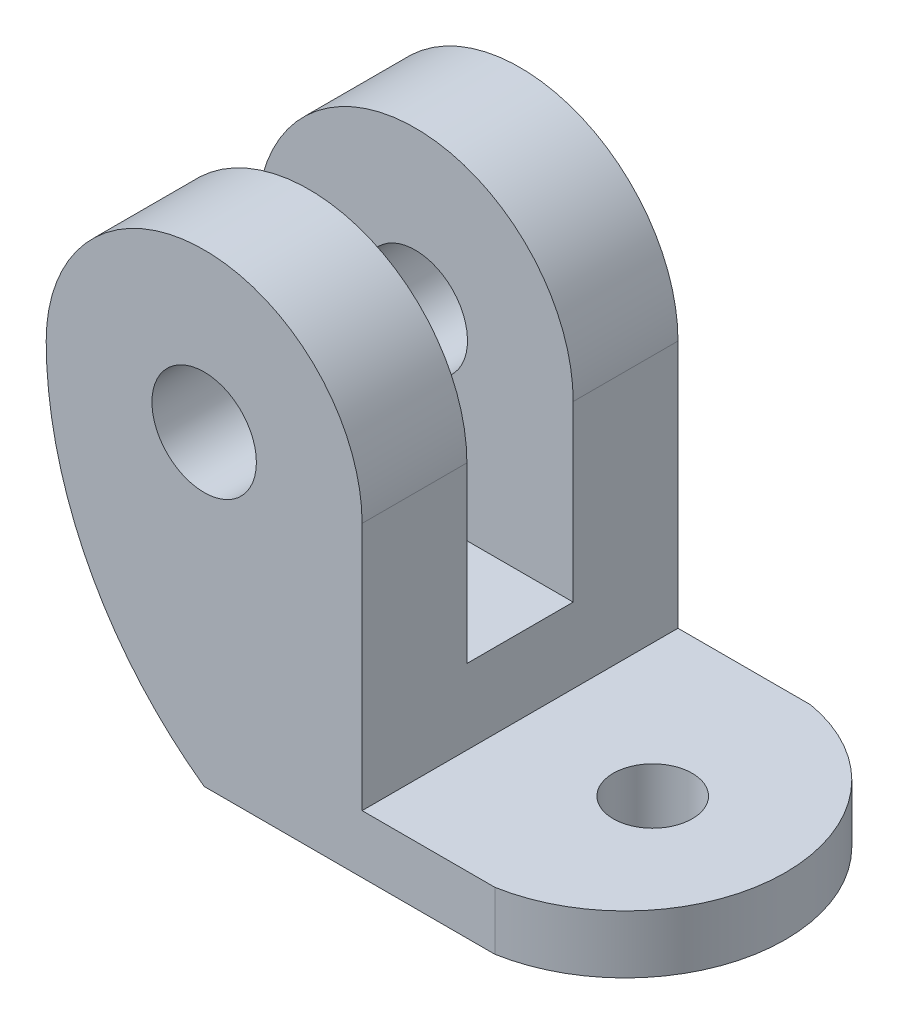
ISO-10303-21;
HEADER;
FILE_DESCRIPTION(('STEP AP214'),'2;1');
FILE_NAME('part.step','',(''),(''),'','','');
FILE_SCHEMA(('AUTOMOTIVE_DESIGN { 1 0 10303 214 1 1 1 1 }'));
ENDSEC;
DATA;
#1=APPLICATION_CONTEXT('core data for automotive mechanical design processes');
#2=APPLICATION_PROTOCOL_DEFINITION('international standard','automotive_design',2000,#1);
#3=PRODUCT_CONTEXT('',#1,'mechanical');
#4=PRODUCT('Part','Part','',(#3));
#5=PRODUCT_RELATED_PRODUCT_CATEGORY('part','',(#4));
#6=PRODUCT_DEFINITION_FORMATION('','',#4);
#7=PRODUCT_DEFINITION_CONTEXT('part definition',#1,'design');
#8=PRODUCT_DEFINITION('design','',#6,#7);
#9=PRODUCT_DEFINITION_SHAPE('','',#8);
#10=(LENGTH_UNIT() NAMED_UNIT(*) SI_UNIT(.MILLI.,.METRE.));
#11=(NAMED_UNIT(*) PLANE_ANGLE_UNIT() SI_UNIT($,.RADIAN.));
#12=(NAMED_UNIT(*) SI_UNIT($,.STERADIAN.) SOLID_ANGLE_UNIT());
#13=UNCERTAINTY_MEASURE_WITH_UNIT(LENGTH_MEASURE(1.E-05),#10,'distance_accuracy_value','');
#14=(GEOMETRIC_REPRESENTATION_CONTEXT(3) GLOBAL_UNCERTAINTY_ASSIGNED_CONTEXT((#13)) GLOBAL_UNIT_ASSIGNED_CONTEXT((#10,
#11,#12)) REPRESENTATION_CONTEXT('',''));
#15=CARTESIAN_POINT('',(0.,0.,0.));
#16=DIRECTION('',(0.,0.,1.));
#17=DIRECTION('',(1.,0.,0.));
#18=AXIS2_PLACEMENT_3D('',#15,#16,#17);
#19=CARTESIAN_POINT('',(4.7625,1.75,9.525));
#20=DIRECTION('',(0.,-1.,0.));
#21=DIRECTION('',(1.,0.,0.));
#22=AXIS2_PLACEMENT_3D('',#19,#20,#21);
#23=PLANE('',#22);
#24=CARTESIAN_POINT('',(8.7625,1.75,4.7625));
#25=DIRECTION('',(0.,1.,0.));
#26=DIRECTION('',(-1.,0.,0.));
#27=AXIS2_PLACEMENT_3D('',#24,#25,#26);
#28=CIRCLE('',#27,1.190625);
#29=CARTESIAN_POINT('',(7.571875,1.75,4.7625));
#30=VERTEX_POINT('',#29);
#31=EDGE_CURVE('E170',#30,#30,#28,.T.);
#32=ORIENTED_EDGE('',*,*,#31,.F.);
#33=EDGE_LOOP('',(#32));
#34=FACE_BOUND('',#33,.T.);
#35=DIRECTION('',(-1.,0.,0.));
#36=VECTOR('',#35,1.);
#37=CARTESIAN_POINT('',(4.7625,1.75,9.525));
#38=LINE('',#37,#36);
#39=CARTESIAN_POINT('',(8.7625,1.75,9.525));
#40=VERTEX_POINT('',#39);
#41=CARTESIAN_POINT('',(4.7625,1.75,9.525));
#42=VERTEX_POINT('',#41);
#43=EDGE_CURVE('E127',#40,#42,#38,.T.);
#44=ORIENTED_EDGE('',*,*,#43,.F.);
#45=CARTESIAN_POINT('',(7.92732421875,1.75,4.7625));
#46=DIRECTION('',(0.,1.,0.));
#47=DIRECTION('',(-1.,0.,0.));
#48=AXIS2_PLACEMENT_3D('',#45,#46,#47);
#49=CIRCLE('',#48,4.83517578125);
#50=CARTESIAN_POINT('',(8.7625,1.75,0.));
#51=VERTEX_POINT('',#50);
#52=EDGE_CURVE('E176',#51,#40,#49,.F.);
#53=ORIENTED_EDGE('',*,*,#52,.F.);
#54=DIRECTION('',(-1.,0.,0.));
#55=VECTOR('',#54,1.);
#56=CARTESIAN_POINT('',(4.7625,1.75,0.));
#57=LINE('',#56,#55);
#58=CARTESIAN_POINT('',(4.7625,1.75,0.));
#59=VERTEX_POINT('',#58);
#60=EDGE_CURVE('E188',#51,#59,#57,.T.);
#61=ORIENTED_EDGE('',*,*,#60,.T.);
#62=DIRECTION('',(0.,0.,-1.));
#63=VECTOR('',#62,1.);
#64=CARTESIAN_POINT('',(4.7625,1.75,9.525));
#65=LINE('',#64,#63);
#66=EDGE_CURVE('E12',#42,#59,#65,.T.);
#67=ORIENTED_EDGE('',*,*,#66,.F.);
#68=EDGE_LOOP('',(#44,#53,#61,#67));
#69=FACE_BOUND('',#68,.T.);
#70=ADVANCED_FACE('F75',(#34,#69),#23,.F.);
#71=CARTESIAN_POINT('',(12.7625,0.,9.525));
#72=DIRECTION('',(0.,1.,0.));
#73=DIRECTION('',(-1.,0.,0.));
#74=AXIS2_PLACEMENT_3D('',#71,#72,#73);
#75=PLANE('',#74);
#76=CARTESIAN_POINT('',(8.7625,0.,4.7625));
#77=DIRECTION('',(0.,1.,0.));
#78=DIRECTION('',(-1.,0.,0.));
#79=AXIS2_PLACEMENT_3D('',#76,#77,#78);
#80=CIRCLE('',#79,1.190625);
#81=CARTESIAN_POINT('',(7.571875,0.,4.7625));
#82=VERTEX_POINT('',#81);
#83=EDGE_CURVE('E222',#82,#82,#80,.F.);
#84=ORIENTED_EDGE('',*,*,#83,.F.);
#85=EDGE_LOOP('',(#84));
#86=FACE_BOUND('',#85,.T.);
#87=CARTESIAN_POINT('',(7.92732421875,0.,4.7625));
#88=DIRECTION('',(0.,1.,0.));
#89=DIRECTION('',(-1.,0.,0.));
#90=AXIS2_PLACEMENT_3D('',#87,#88,#89);
#91=CIRCLE('',#90,4.83517578125);
#92=CARTESIAN_POINT('',(8.7625,0.,9.525));
#93=VERTEX_POINT('',#92);
#94=CARTESIAN_POINT('',(8.7625,0.,0.));
#95=VERTEX_POINT('',#94);
#96=EDGE_CURVE('E162',#93,#95,#91,.T.);
#97=ORIENTED_EDGE('',*,*,#96,.F.);
#98=DIRECTION('',(1.,0.,0.));
#99=VECTOR('',#98,1.);
#100=CARTESIAN_POINT('',(12.7625,0.,9.525));
#101=LINE('',#100,#99);
#102=CARTESIAN_POINT('',(0.,0.,9.525));
#103=VERTEX_POINT('',#102);
#104=EDGE_CURVE('E165',#103,#93,#101,.T.);
#105=ORIENTED_EDGE('',*,*,#104,.F.);
#106=DIRECTION('',(0.,0.,-1.));
#107=VECTOR('',#106,1.);
#108=CARTESIAN_POINT('',(0.,0.,9.525));
#109=LINE('',#108,#107);
#110=CARTESIAN_POINT('',(0.,0.,0.));
#111=VERTEX_POINT('',#110);
#112=EDGE_CURVE('E180',#103,#111,#109,.T.);
#113=ORIENTED_EDGE('',*,*,#112,.T.);
#114=DIRECTION('',(1.,0.,0.));
#115=VECTOR('',#114,1.);
#116=CARTESIAN_POINT('',(12.7625,0.,0.));
#117=LINE('',#116,#115);
#118=EDGE_CURVE('E167',#111,#95,#117,.T.);
#119=ORIENTED_EDGE('',*,*,#118,.T.);
#120=EDGE_LOOP('',(#97,#105,#113,#119));
#121=FACE_BOUND('',#120,.T.);
#122=ADVANCED_FACE('F164',(#86,#121),#75,.F.);
#123=CARTESIAN_POINT('',(4.76249999999999,9.25,9.525));
#124=DIRECTION('',(-1.,0.,0.));
#125=DIRECTION('',(0.,-1.,0.));
#126=AXIS2_PLACEMENT_3D('',#123,#124,#125);
#127=PLANE('',#126);
#128=DIRECTION('',(0.,1.,0.));
#129=VECTOR('',#128,1.);
#130=CARTESIAN_POINT('',(4.7625,14.0125,6.365));
#131=LINE('',#130,#129);
#132=CARTESIAN_POINT('',(4.7625,4.01249999999999,6.365));
#133=VERTEX_POINT('',#132);
#134=CARTESIAN_POINT('',(4.7625,9.25,6.365));
#135=VERTEX_POINT('',#134);
#136=EDGE_CURVE('E225',#133,#135,#131,.T.);
#137=ORIENTED_EDGE('',*,*,#136,.T.);
#138=DIRECTION('',(0.,0.,-1.));
#139=VECTOR('',#138,1.);
#140=CARTESIAN_POINT('',(4.76249999999999,9.25,9.525));
#141=LINE('',#140,#139);
#142=CARTESIAN_POINT('',(4.76249999999999,9.25,9.525));
#143=VERTEX_POINT('',#142);
#144=EDGE_CURVE('E83',#143,#135,#141,.T.);
#145=ORIENTED_EDGE('',*,*,#144,.F.);
#146=DIRECTION('',(0.,1.,0.));
#147=VECTOR('',#146,1.);
#148=CARTESIAN_POINT('',(4.76249999999999,9.25,9.525));
#149=LINE('',#148,#147);
#150=EDGE_CURVE('E242',#42,#143,#149,.T.);
#151=ORIENTED_EDGE('',*,*,#150,.F.);
#152=ORIENTED_EDGE('',*,*,#66,.T.);
#153=DIRECTION('',(0.,1.,0.));
#154=VECTOR('',#153,1.);
#155=CARTESIAN_POINT('',(4.76249999999999,9.25,0.));
#156=LINE('',#155,#154);
#157=CARTESIAN_POINT('',(4.76249999999999,9.25,0.));
#158=VERTEX_POINT('',#157);
#159=EDGE_CURVE('E190',#59,#158,#156,.T.);
#160=ORIENTED_EDGE('',*,*,#159,.T.);
#161=CARTESIAN_POINT('',(4.7625,9.25,3.16));
#162=VERTEX_POINT('',#161);
#163=EDGE_CURVE('E202',#162,#158,#141,.T.);
#164=ORIENTED_EDGE('',*,*,#163,.F.);
#165=DIRECTION('',(0.,-1.,0.));
#166=VECTOR('',#165,1.);
#167=CARTESIAN_POINT('',(4.7625,4.01249999999999,3.16));
#168=LINE('',#167,#166);
#169=CARTESIAN_POINT('',(4.7625,4.01249999999999,3.16));
#170=VERTEX_POINT('',#169);
#171=EDGE_CURVE('E218',#162,#170,#168,.T.);
#172=ORIENTED_EDGE('',*,*,#171,.T.);
#173=DIRECTION('',(0.,0.,1.));
#174=VECTOR('',#173,1.);
#175=CARTESIAN_POINT('',(4.7625,4.01249999999999,6.365));
#176=LINE('',#175,#174);
#177=EDGE_CURVE('E221',#170,#133,#176,.T.);
#178=ORIENTED_EDGE('',*,*,#177,.T.);
#179=EDGE_LOOP('',(#137,#145,#151,#152,#160,#164,#172,#178));
#180=FACE_BOUND('',#179,.T.);
#181=ADVANCED_FACE('F267',(#180),#127,.F.);
#182=CARTESIAN_POINT('',(0.,9.25,9.525));
#183=DIRECTION('',(0.,0.,-1.));
#184=DIRECTION('',(-1.,0.,0.));
#185=AXIS2_PLACEMENT_3D('',#182,#183,#184);
#186=CYLINDRICAL_SURFACE('',#185,4.76249999999999);
#187=CARTESIAN_POINT('',(0.,9.25,6.365));
#188=DIRECTION('',(0.,0.,-1.));
#189=DIRECTION('',(0.,1.,0.));
#190=AXIS2_PLACEMENT_3D('',#187,#188,#189);
#191=CIRCLE('',#190,4.76249999999999);
#192=CARTESIAN_POINT('',(-4.76249999999999,9.25,6.365));
#193=VERTEX_POINT('',#192);
#194=EDGE_CURVE('E234',#193,#135,#191,.T.);
#195=ORIENTED_EDGE('',*,*,#194,.F.);
#196=DIRECTION('',(0.,0.,-1.));
#197=VECTOR('',#196,1.);
#198=CARTESIAN_POINT('',(-4.7625,9.25,9.525));
#199=LINE('',#198,#197);
#200=CARTESIAN_POINT('',(-4.7625,9.25,9.525));
#201=VERTEX_POINT('',#200);
#202=EDGE_CURVE('E199',#201,#193,#199,.T.);
#203=ORIENTED_EDGE('',*,*,#202,.F.);
#204=CARTESIAN_POINT('',(0.,9.25,9.525));
#205=DIRECTION('',(0.,0.,1.));
#206=DIRECTION('',(-1.,0.,0.));
#207=AXIS2_PLACEMENT_3D('',#204,#205,#206);
#208=CIRCLE('',#207,4.76249999999999);
#209=EDGE_CURVE('E184',#143,#201,#208,.T.);
#210=ORIENTED_EDGE('',*,*,#209,.F.);
#211=ORIENTED_EDGE('',*,*,#144,.T.);
#212=EDGE_LOOP('',(#195,#203,#210,#211));
#213=FACE_BOUND('',#212,.T.);
#214=ADVANCED_FACE('F247',(#213),#186,.T.);
#215=CARTESIAN_POINT('',(0.,9.25,3.16));
#216=DIRECTION('',(0.,0.,1.));
#217=DIRECTION('',(0.,-1.,0.));
#218=AXIS2_PLACEMENT_3D('',#215,#216,#217);
#219=CIRCLE('',#218,4.76249999999999);
#220=CARTESIAN_POINT('',(-4.7625,9.25,3.16));
#221=VERTEX_POINT('',#220);
#222=EDGE_CURVE('E91',#162,#221,#219,.T.);
#223=ORIENTED_EDGE('',*,*,#222,.F.);
#224=ORIENTED_EDGE('',*,*,#163,.T.);
#225=CARTESIAN_POINT('',(0.,9.25,0.));
#226=DIRECTION('',(0.,0.,1.));
#227=DIRECTION('',(-1.,0.,0.));
#228=AXIS2_PLACEMENT_3D('',#225,#226,#227);
#229=CIRCLE('',#228,4.76249999999999);
#230=CARTESIAN_POINT('',(-4.7625,9.25,0.));
#231=VERTEX_POINT('',#230);
#232=EDGE_CURVE('E194',#158,#231,#229,.T.);
#233=ORIENTED_EDGE('',*,*,#232,.T.);
#234=EDGE_CURVE('E182',#221,#231,#199,.T.);
#235=ORIENTED_EDGE('',*,*,#234,.F.);
#236=EDGE_LOOP('',(#223,#224,#233,#235));
#237=FACE_BOUND('',#236,.T.);
#238=ADVANCED_FACE('F281',(#237),#186,.T.);
#239=CARTESIAN_POINT('',(6.60168963254579,9.24999999999992,9.525));
#240=DIRECTION('',(0.,0.,-1.));
#241=DIRECTION('',(-1.,0.,0.));
#242=AXIS2_PLACEMENT_3D('',#239,#240,#241);
#243=CYLINDRICAL_SURFACE('',#242,11.3641896325458);
#244=CARTESIAN_POINT('',(6.60168963254579,9.24999999999992,6.365));
#245=DIRECTION('',(0.,0.,-1.));
#246=DIRECTION('',(0.,1.,0.));
#247=AXIS2_PLACEMENT_3D('',#244,#245,#246);
#248=CIRCLE('',#247,11.3641896325458);
#249=CARTESIAN_POINT('',(-3.48361649837864,4.01249999999999,6.365));
#250=VERTEX_POINT('',#249);
#251=EDGE_CURVE('E214',#193,#250,#248,.F.);
#252=ORIENTED_EDGE('',*,*,#251,.T.);
#253=DIRECTION('',(0.,0.,-1.));
#254=VECTOR('',#253,1.);
#255=CARTESIAN_POINT('',(-3.48361649837864,4.01249999999999,9.525));
#256=LINE('',#255,#254);
#257=CARTESIAN_POINT('',(-3.48361649837864,4.01249999999999,3.16));
#258=VERTEX_POINT('',#257);
#259=EDGE_CURVE('E210',#250,#258,#256,.T.);
#260=ORIENTED_EDGE('',*,*,#259,.T.);
#261=CARTESIAN_POINT('',(6.60168963254579,9.24999999999992,3.16));
#262=DIRECTION('',(0.,0.,1.));
#263=DIRECTION('',(0.,-1.,0.));
#264=AXIS2_PLACEMENT_3D('',#261,#262,#263);
#265=CIRCLE('',#264,11.3641896325458);
#266=EDGE_CURVE('E206',#258,#221,#265,.F.);
#267=ORIENTED_EDGE('',*,*,#266,.T.);
#268=ORIENTED_EDGE('',*,*,#234,.T.);
#269=CARTESIAN_POINT('',(6.60168963254579,9.24999999999992,0.));
#270=DIRECTION('',(0.,0.,1.));
#271=DIRECTION('',(1.,0.,0.));
#272=AXIS2_PLACEMENT_3D('',#269,#270,#271);
#273=CIRCLE('',#272,11.3641896325458);
#274=EDGE_CURVE('E120',#231,#111,#273,.T.);
#275=ORIENTED_EDGE('',*,*,#274,.T.);
#276=ORIENTED_EDGE('',*,*,#112,.F.);
#277=CARTESIAN_POINT('',(6.60168963254579,9.24999999999992,9.525));
#278=DIRECTION('',(0.,0.,1.));
#279=DIRECTION('',(1.,0.,0.));
#280=AXIS2_PLACEMENT_3D('',#277,#278,#279);
#281=CIRCLE('',#280,11.3641896325458);
#282=EDGE_CURVE('E100',#201,#103,#281,.T.);
#283=ORIENTED_EDGE('',*,*,#282,.F.);
#284=ORIENTED_EDGE('',*,*,#202,.T.);
#285=EDGE_LOOP('',(#252,#260,#267,#268,#275,#276,#283,#284));
#286=FACE_BOUND('',#285,.T.);
#287=ADVANCED_FACE('F249',(#286),#243,.T.);
#288=CARTESIAN_POINT('',(0.,9.25,9.525));
#289=DIRECTION('',(0.,0.,-1.));
#290=DIRECTION('',(-1.,0.,0.));
#291=AXIS2_PLACEMENT_3D('',#288,#289,#290);
#292=CYLINDRICAL_SURFACE('',#291,1.575);
#293=CARTESIAN_POINT('',(0.,9.25,9.525));
#294=DIRECTION('',(0.,0.,1.));
#295=DIRECTION('',(1.,0.,0.));
#296=AXIS2_PLACEMENT_3D('',#293,#294,#295);
#297=CIRCLE('',#296,1.575);
#298=CARTESIAN_POINT('',(1.575,9.25,9.525));
#299=VERTEX_POINT('',#298);
#300=EDGE_CURVE('E191',#299,#299,#297,.T.);
#301=ORIENTED_EDGE('',*,*,#300,.T.);
#302=EDGE_LOOP('',(#301));
#303=FACE_BOUND('',#302,.T.);
#304=CARTESIAN_POINT('',(0.,9.25,6.365));
#305=DIRECTION('',(0.,0.,-1.));
#306=DIRECTION('',(0.,1.,0.));
#307=AXIS2_PLACEMENT_3D('',#304,#305,#306);
#308=CIRCLE('',#307,1.575);
#309=CARTESIAN_POINT('',(0.,10.825,6.365));
#310=VERTEX_POINT('',#309);
#311=EDGE_CURVE('E78',#310,#310,#308,.T.);
#312=ORIENTED_EDGE('',*,*,#311,.T.);
#313=EDGE_LOOP('',(#312));
#314=FACE_BOUND('',#313,.T.);
#315=ADVANCED_FACE('F280',(#303,#314),#292,.F.);
#316=CARTESIAN_POINT('',(0.,9.25,0.));
#317=DIRECTION('',(0.,0.,1.));
#318=DIRECTION('',(1.,0.,0.));
#319=AXIS2_PLACEMENT_3D('',#316,#317,#318);
#320=CIRCLE('',#319,1.575);
#321=CARTESIAN_POINT('',(1.575,9.25,0.));
#322=VERTEX_POINT('',#321);
#323=EDGE_CURVE('E236',#322,#322,#320,.T.);
#324=ORIENTED_EDGE('',*,*,#323,.F.);
#325=EDGE_LOOP('',(#324));
#326=FACE_BOUND('',#325,.T.);
#327=CARTESIAN_POINT('',(0.,9.25,3.16));
#328=DIRECTION('',(0.,0.,1.));
#329=DIRECTION('',(0.,-1.,0.));
#330=AXIS2_PLACEMENT_3D('',#327,#328,#329);
#331=CIRCLE('',#330,1.575);
#332=CARTESIAN_POINT('',(0.,7.675,3.16));
#333=VERTEX_POINT('',#332);
#334=EDGE_CURVE('E204',#333,#333,#331,.T.);
#335=ORIENTED_EDGE('',*,*,#334,.T.);
#336=EDGE_LOOP('',(#335));
#337=FACE_BOUND('',#336,.T.);
#338=ADVANCED_FACE('F313',(#326,#337),#292,.F.);
#339=CARTESIAN_POINT('',(6.60168963254579,9.24999999999992,9.525));
#340=DIRECTION('',(0.,0.,1.));
#341=DIRECTION('',(1.,0.,0.));
#342=AXIS2_PLACEMENT_3D('',#339,#340,#341);
#343=PLANE('',#342);
#344=DIRECTION('',(0.,1.,0.));
#345=VECTOR('',#344,1.);
#346=CARTESIAN_POINT('',(8.7625,-6.21943777603732,9.525));
#347=LINE('',#346,#345);
#348=EDGE_CURVE('E173',#93,#40,#347,.T.);
#349=ORIENTED_EDGE('',*,*,#348,.T.);
#350=ORIENTED_EDGE('',*,*,#43,.T.);
#351=ORIENTED_EDGE('',*,*,#150,.T.);
#352=ORIENTED_EDGE('',*,*,#209,.T.);
#353=ORIENTED_EDGE('',*,*,#282,.T.);
#354=ORIENTED_EDGE('',*,*,#104,.T.);
#355=EDGE_LOOP('',(#349,#350,#351,#352,#353,#354));
#356=FACE_BOUND('',#355,.T.);
#357=ORIENTED_EDGE('',*,*,#300,.F.);
#358=EDGE_LOOP('',(#357));
#359=FACE_BOUND('',#358,.T.);
#360=ADVANCED_FACE('F178',(#356,#359),#343,.T.);
#361=CARTESIAN_POINT('',(6.60168963254579,9.24999999999992,0.));
#362=DIRECTION('',(0.,0.,1.));
#363=DIRECTION('',(1.,0.,0.));
#364=AXIS2_PLACEMENT_3D('',#361,#362,#363);
#365=PLANE('',#364);
#366=ORIENTED_EDGE('',*,*,#60,.F.);
#367=DIRECTION('',(0.,1.,0.));
#368=VECTOR('',#367,1.);
#369=CARTESIAN_POINT('',(8.7625,-6.21943777603732,0.));
#370=LINE('',#369,#368);
#371=EDGE_CURVE('E171',#95,#51,#370,.T.);
#372=ORIENTED_EDGE('',*,*,#371,.F.);
#373=ORIENTED_EDGE('',*,*,#118,.F.);
#374=ORIENTED_EDGE('',*,*,#274,.F.);
#375=ORIENTED_EDGE('',*,*,#232,.F.);
#376=ORIENTED_EDGE('',*,*,#159,.F.);
#377=EDGE_LOOP('',(#366,#372,#373,#374,#375,#376));
#378=FACE_BOUND('',#377,.T.);
#379=ORIENTED_EDGE('',*,*,#323,.T.);
#380=EDGE_LOOP('',(#379));
#381=FACE_BOUND('',#380,.T.);
#382=ADVANCED_FACE('F252',(#378,#381),#365,.F.);
#383=CARTESIAN_POINT('',(-4.7635,14.0125,6.365));
#384=DIRECTION('',(0.,0.,-1.));
#385=DIRECTION('',(0.,1.,0.));
#386=AXIS2_PLACEMENT_3D('',#383,#384,#385);
#387=PLANE('',#386);
#388=ORIENTED_EDGE('',*,*,#311,.F.);
#389=EDGE_LOOP('',(#388));
#390=FACE_BOUND('',#389,.T.);
#391=ORIENTED_EDGE('',*,*,#194,.T.);
#392=ORIENTED_EDGE('',*,*,#136,.F.);
#393=DIRECTION('',(1.,0.,0.));
#394=VECTOR('',#393,1.);
#395=CARTESIAN_POINT('',(-4.7635,4.0125,6.365));
#396=LINE('',#395,#394);
#397=EDGE_CURVE('E228',#250,#133,#396,.T.);
#398=ORIENTED_EDGE('',*,*,#397,.F.);
#399=ORIENTED_EDGE('',*,*,#251,.F.);
#400=EDGE_LOOP('',(#391,#392,#398,#399));
#401=FACE_BOUND('',#400,.T.);
#402=ADVANCED_FACE('F296',(#390,#401),#387,.T.);
#403=CARTESIAN_POINT('',(-4.7635,4.0125,3.16));
#404=DIRECTION('',(0.,0.,1.));
#405=DIRECTION('',(0.,-1.,0.));
#406=AXIS2_PLACEMENT_3D('',#403,#404,#405);
#407=PLANE('',#406);
#408=ORIENTED_EDGE('',*,*,#334,.F.);
#409=EDGE_LOOP('',(#408));
#410=FACE_BOUND('',#409,.T.);
#411=ORIENTED_EDGE('',*,*,#222,.T.);
#412=ORIENTED_EDGE('',*,*,#266,.F.);
#413=DIRECTION('',(1.,0.,0.));
#414=VECTOR('',#413,1.);
#415=CARTESIAN_POINT('',(-4.7635,4.0125,3.16));
#416=LINE('',#415,#414);
#417=EDGE_CURVE('E230',#258,#170,#416,.T.);
#418=ORIENTED_EDGE('',*,*,#417,.T.);
#419=ORIENTED_EDGE('',*,*,#171,.F.);
#420=EDGE_LOOP('',(#411,#412,#418,#419));
#421=FACE_BOUND('',#420,.T.);
#422=ADVANCED_FACE('F300',(#410,#421),#407,.T.);
#423=CARTESIAN_POINT('',(-4.7635,4.0125,6.365));
#424=DIRECTION('',(0.,1.,0.));
#425=DIRECTION('',(-1.,0.,0.));
#426=AXIS2_PLACEMENT_3D('',#423,#424,#425);
#427=PLANE('',#426);
#428=ORIENTED_EDGE('',*,*,#397,.T.);
#429=ORIENTED_EDGE('',*,*,#177,.F.);
#430=ORIENTED_EDGE('',*,*,#417,.F.);
#431=ORIENTED_EDGE('',*,*,#259,.F.);
#432=EDGE_LOOP('',(#428,#429,#430,#431));
#433=FACE_BOUND('',#432,.T.);
#434=ADVANCED_FACE('F299',(#433),#427,.T.);
#435=CARTESIAN_POINT('',(8.7625,-6.21943777603732,4.7625));
#436=DIRECTION('',(0.,1.,0.));
#437=DIRECTION('',(-1.,0.,0.));
#438=AXIS2_PLACEMENT_3D('',#435,#436,#437);
#439=CYLINDRICAL_SURFACE('',#438,1.190625);
#440=ORIENTED_EDGE('',*,*,#83,.T.);
#441=EDGE_LOOP('',(#440));
#442=FACE_BOUND('',#441,.T.);
#443=ORIENTED_EDGE('',*,*,#31,.T.);
#444=EDGE_LOOP('',(#443));
#445=FACE_BOUND('',#444,.T.);
#446=ADVANCED_FACE('F263',(#442,#445),#439,.F.);
#447=CARTESIAN_POINT('',(7.92732421875,-6.21943777603732,4.7625));
#448=DIRECTION('',(0.,1.,0.));
#449=DIRECTION('',(-1.,0.,0.));
#450=AXIS2_PLACEMENT_3D('',#447,#448,#449);
#451=CYLINDRICAL_SURFACE('',#450,4.83517578125);
#452=ORIENTED_EDGE('',*,*,#96,.T.);
#453=ORIENTED_EDGE('',*,*,#371,.T.);
#454=ORIENTED_EDGE('',*,*,#52,.T.);
#455=ORIENTED_EDGE('',*,*,#348,.F.);
#456=EDGE_LOOP('',(#452,#453,#454,#455));
#457=FACE_BOUND('',#456,.T.);
#458=ADVANCED_FACE('F174',(#457),#451,.T.);
#459=CLOSED_SHELL('',(#70,#122,#181,#214,#238,#287,#315,#338,#360,#382,#402,#422,#434,#446,#458));
#460=MANIFOLD_SOLID_BREP('B2',#459);
#461=ADVANCED_BREP_SHAPE_REPRESENTATION('',(#18,#460),#14);
#462=SHAPE_DEFINITION_REPRESENTATION(#9,#461);
ENDSEC;
END-ISO-10303-21;
